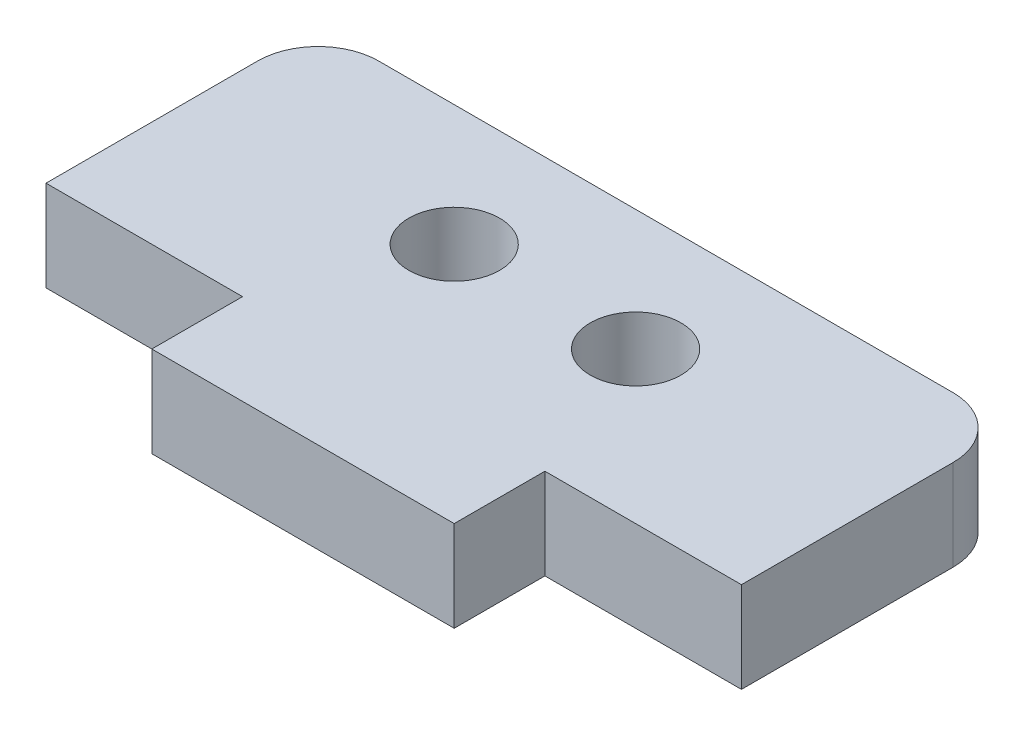
ISO-10303-21;
HEADER;
FILE_DESCRIPTION(('STEP AP214'),'2;1');
FILE_NAME('part.step','',(''),(''),'','','');
FILE_SCHEMA(('AUTOMOTIVE_DESIGN { 1 0 10303 214 1 1 1 1 }'));
ENDSEC;
DATA;
#1=APPLICATION_CONTEXT('core data for automotive mechanical design processes');
#2=APPLICATION_PROTOCOL_DEFINITION('international standard','automotive_design',2000,#1);
#3=PRODUCT_CONTEXT('',#1,'mechanical');
#4=PRODUCT('Part','Part','',(#3));
#5=PRODUCT_RELATED_PRODUCT_CATEGORY('part','',(#4));
#6=PRODUCT_DEFINITION_FORMATION('','',#4);
#7=PRODUCT_DEFINITION_CONTEXT('part definition',#1,'design');
#8=PRODUCT_DEFINITION('design','',#6,#7);
#9=PRODUCT_DEFINITION_SHAPE('','',#8);
#10=(LENGTH_UNIT() NAMED_UNIT(*) SI_UNIT(.MILLI.,.METRE.));
#11=(NAMED_UNIT(*) PLANE_ANGLE_UNIT() SI_UNIT($,.RADIAN.));
#12=(NAMED_UNIT(*) SI_UNIT($,.STERADIAN.) SOLID_ANGLE_UNIT());
#13=UNCERTAINTY_MEASURE_WITH_UNIT(LENGTH_MEASURE(1.E-05),#10,'distance_accuracy_value','');
#14=(GEOMETRIC_REPRESENTATION_CONTEXT(3) GLOBAL_UNCERTAINTY_ASSIGNED_CONTEXT((#13)) GLOBAL_UNIT_ASSIGNED_CONTEXT((#10,
#11,#12)) REPRESENTATION_CONTEXT('',''));
#15=CARTESIAN_POINT('',(0.,0.,0.));
#16=DIRECTION('',(0.,0.,1.));
#17=DIRECTION('',(1.,0.,0.));
#18=AXIS2_PLACEMENT_3D('',#15,#16,#17);
#19=CARTESIAN_POINT('',(7.87032258064516,3.,0.374193548387096));
#20=DIRECTION('',(0.,-1.,0.));
#21=DIRECTION('',(0.,0.,-1.));
#22=AXIS2_PLACEMENT_3D('',#19,#20,#21);
#23=PLANE('',#22);
#24=CARTESIAN_POINT('',(-4.62967741935484,3.,2.3741935483871));
#25=DIRECTION('',(0.,1.,0.));
#26=DIRECTION('',(0.,0.,1.));
#27=AXIS2_PLACEMENT_3D('',#24,#25,#26);
#28=CIRCLE('',#27,1.5);
#29=CARTESIAN_POINT('',(-4.62967741935484,3.,3.8741935483871));
#30=VERTEX_POINT('',#29);
#31=EDGE_CURVE('E145',#30,#30,#28,.T.);
#32=ORIENTED_EDGE('',*,*,#31,.F.);
#33=EDGE_LOOP('',(#32));
#34=FACE_BOUND('',#33,.T.);
#35=CARTESIAN_POINT('',(7.87032258064516,3.,0.374193548387096));
#36=DIRECTION('',(0.,1.,0.));
#37=DIRECTION('',(0.,0.,-1.));
#38=AXIS2_PLACEMENT_3D('',#35,#36,#37);
#39=CIRCLE('',#38,2.);
#40=CARTESIAN_POINT('',(9.87032258064516,3.,0.37419354838711));
#41=VERTEX_POINT('',#40);
#42=CARTESIAN_POINT('',(7.87032258064515,3.,-1.6258064516129));
#43=VERTEX_POINT('',#42);
#44=EDGE_CURVE('E160',#41,#43,#39,.T.);
#45=ORIENTED_EDGE('',*,*,#44,.T.);
#46=DIRECTION('',(-1.,0.,0.));
#47=VECTOR('',#46,1.);
#48=CARTESIAN_POINT('',(-11.1296774193548,3.,-1.6258064516129));
#49=LINE('',#48,#47);
#50=CARTESIAN_POINT('',(-11.1296774193548,3.,-1.6258064516129));
#51=VERTEX_POINT('',#50);
#52=EDGE_CURVE('E98',#43,#51,#49,.T.);
#53=ORIENTED_EDGE('',*,*,#52,.T.);
#54=CARTESIAN_POINT('',(-11.1296774193548,3.,0.374193548387096));
#55=DIRECTION('',(0.,1.,0.));
#56=DIRECTION('',(0.,0.,1.));
#57=AXIS2_PLACEMENT_3D('',#54,#55,#56);
#58=CIRCLE('',#57,2.);
#59=CARTESIAN_POINT('',(-13.1296774193548,3.,0.37419354838711));
#60=VERTEX_POINT('',#59);
#61=EDGE_CURVE('E181',#51,#60,#58,.T.);
#62=ORIENTED_EDGE('',*,*,#61,.T.);
#63=DIRECTION('',(0.,0.,1.));
#64=VECTOR('',#63,1.);
#65=CARTESIAN_POINT('',(-13.1296774193548,3.,0.374193548387111));
#66=LINE('',#65,#64);
#67=CARTESIAN_POINT('',(-13.1296774193548,3.,7.3741935483871));
#68=VERTEX_POINT('',#67);
#69=EDGE_CURVE('E200',#60,#68,#66,.T.);
#70=ORIENTED_EDGE('',*,*,#69,.T.);
#71=DIRECTION('',(1.,0.,0.));
#72=VECTOR('',#71,1.);
#73=CARTESIAN_POINT('',(-13.1296774193548,3.,7.3741935483871));
#74=LINE('',#73,#72);
#75=CARTESIAN_POINT('',(-6.62967741935484,3.,7.3741935483871));
#76=VERTEX_POINT('',#75);
#77=EDGE_CURVE('E197',#68,#76,#74,.T.);
#78=ORIENTED_EDGE('',*,*,#77,.T.);
#79=DIRECTION('',(0.,0.,1.));
#80=VECTOR('',#79,1.);
#81=CARTESIAN_POINT('',(-6.62967741935484,3.,7.3741935483871));
#82=LINE('',#81,#80);
#83=CARTESIAN_POINT('',(-6.62967741935484,3.,10.3741935483871));
#84=VERTEX_POINT('',#83);
#85=EDGE_CURVE('E199',#76,#84,#82,.T.);
#86=ORIENTED_EDGE('',*,*,#85,.T.);
#87=DIRECTION('',(1.,0.,0.));
#88=VECTOR('',#87,1.);
#89=CARTESIAN_POINT('',(-6.62967741935484,3.,10.3741935483871));
#90=LINE('',#89,#88);
#91=CARTESIAN_POINT('',(3.37032258064516,3.,10.3741935483871));
#92=VERTEX_POINT('',#91);
#93=EDGE_CURVE('E123',#84,#92,#90,.T.);
#94=ORIENTED_EDGE('',*,*,#93,.T.);
#95=DIRECTION('',(0.,0.,-1.));
#96=VECTOR('',#95,1.);
#97=CARTESIAN_POINT('',(3.37032258064516,3.,7.3741935483871));
#98=LINE('',#97,#96);
#99=CARTESIAN_POINT('',(3.37032258064516,3.,7.3741935483871));
#100=VERTEX_POINT('',#99);
#101=EDGE_CURVE('E117',#92,#100,#98,.T.);
#102=ORIENTED_EDGE('',*,*,#101,.T.);
#103=DIRECTION('',(1.,0.,0.));
#104=VECTOR('',#103,1.);
#105=CARTESIAN_POINT('',(3.37032258064516,3.,7.3741935483871));
#106=LINE('',#105,#104);
#107=CARTESIAN_POINT('',(9.87032258064516,3.,7.3741935483871));
#108=VERTEX_POINT('',#107);
#109=EDGE_CURVE('E121',#100,#108,#106,.T.);
#110=ORIENTED_EDGE('',*,*,#109,.T.);
#111=DIRECTION('',(0.,0.,-1.));
#112=VECTOR('',#111,1.);
#113=CARTESIAN_POINT('',(9.87032258064516,3.,0.37419354838711));
#114=LINE('',#113,#112);
#115=EDGE_CURVE('E49',#108,#41,#114,.T.);
#116=ORIENTED_EDGE('',*,*,#115,.T.);
#117=EDGE_LOOP('',(#45,#53,#62,#70,#78,#86,#94,#102,#110,#116));
#118=FACE_BOUND('',#117,.T.);
#119=CARTESIAN_POINT('',(1.37032258064516,3.,2.3741935483871));
#120=DIRECTION('',(0.,1.,0.));
#121=DIRECTION('',(0.,0.,1.));
#122=AXIS2_PLACEMENT_3D('',#119,#120,#121);
#123=CIRCLE('',#122,1.5);
#124=CARTESIAN_POINT('',(1.37032258064516,3.,3.8741935483871));
#125=VERTEX_POINT('',#124);
#126=EDGE_CURVE('E211',#125,#125,#123,.T.);
#127=ORIENTED_EDGE('',*,*,#126,.F.);
#128=EDGE_LOOP('',(#127));
#129=FACE_BOUND('',#128,.T.);
#130=ADVANCED_FACE('F32',(#34,#118,#129),#23,.F.);
#131=CARTESIAN_POINT('',(7.87032258064516,0.,0.374193548387096));
#132=DIRECTION('',(0.,-1.,0.));
#133=DIRECTION('',(0.,0.,-1.));
#134=AXIS2_PLACEMENT_3D('',#131,#132,#133);
#135=PLANE('',#134);
#136=CARTESIAN_POINT('',(-4.62967741935484,0.,2.3741935483871));
#137=DIRECTION('',(0.,1.,0.));
#138=DIRECTION('',(0.,0.,1.));
#139=AXIS2_PLACEMENT_3D('',#136,#137,#138);
#140=CIRCLE('',#139,1.5);
#141=CARTESIAN_POINT('',(-4.62967741935484,0.,3.8741935483871));
#142=VERTEX_POINT('',#141);
#143=EDGE_CURVE('E208',#142,#142,#140,.T.);
#144=ORIENTED_EDGE('',*,*,#143,.T.);
#145=EDGE_LOOP('',(#144));
#146=FACE_BOUND('',#145,.T.);
#147=CARTESIAN_POINT('',(7.87032258064516,0.,0.374193548387096));
#148=DIRECTION('',(0.,1.,0.));
#149=DIRECTION('',(0.,0.,-1.));
#150=AXIS2_PLACEMENT_3D('',#147,#148,#149);
#151=CIRCLE('',#150,2.);
#152=CARTESIAN_POINT('',(9.87032258064516,0.,0.37419354838711));
#153=VERTEX_POINT('',#152);
#154=CARTESIAN_POINT('',(7.87032258064515,0.,-1.6258064516129));
#155=VERTEX_POINT('',#154);
#156=EDGE_CURVE('E141',#153,#155,#151,.T.);
#157=ORIENTED_EDGE('',*,*,#156,.F.);
#158=DIRECTION('',(0.,0.,-1.));
#159=VECTOR('',#158,1.);
#160=CARTESIAN_POINT('',(9.87032258064516,0.,0.37419354838711));
#161=LINE('',#160,#159);
#162=CARTESIAN_POINT('',(9.87032258064516,0.,7.3741935483871));
#163=VERTEX_POINT('',#162);
#164=EDGE_CURVE('E90',#163,#153,#161,.T.);
#165=ORIENTED_EDGE('',*,*,#164,.F.);
#166=DIRECTION('',(1.,0.,0.));
#167=VECTOR('',#166,1.);
#168=CARTESIAN_POINT('',(3.37032258064516,0.,7.3741935483871));
#169=LINE('',#168,#167);
#170=CARTESIAN_POINT('',(3.37032258064516,0.,7.3741935483871));
#171=VERTEX_POINT('',#170);
#172=EDGE_CURVE('E84',#171,#163,#169,.T.);
#173=ORIENTED_EDGE('',*,*,#172,.F.);
#174=DIRECTION('',(0.,0.,-1.));
#175=VECTOR('',#174,1.);
#176=CARTESIAN_POINT('',(3.37032258064516,0.,7.3741935483871));
#177=LINE('',#176,#175);
#178=CARTESIAN_POINT('',(3.37032258064516,0.,10.3741935483871));
#179=VERTEX_POINT('',#178);
#180=EDGE_CURVE('E131',#179,#171,#177,.T.);
#181=ORIENTED_EDGE('',*,*,#180,.F.);
#182=DIRECTION('',(1.,0.,0.));
#183=VECTOR('',#182,1.);
#184=CARTESIAN_POINT('',(-6.62967741935484,0.,10.3741935483871));
#185=LINE('',#184,#183);
#186=CARTESIAN_POINT('',(-6.62967741935484,0.,10.3741935483871));
#187=VERTEX_POINT('',#186);
#188=EDGE_CURVE('E155',#187,#179,#185,.T.);
#189=ORIENTED_EDGE('',*,*,#188,.F.);
#190=DIRECTION('',(0.,0.,1.));
#191=VECTOR('',#190,1.);
#192=CARTESIAN_POINT('',(-6.62967741935484,0.,7.3741935483871));
#193=LINE('',#192,#191);
#194=CARTESIAN_POINT('',(-6.62967741935484,0.,7.3741935483871));
#195=VERTEX_POINT('',#194);
#196=EDGE_CURVE('E153',#195,#187,#193,.T.);
#197=ORIENTED_EDGE('',*,*,#196,.F.);
#198=DIRECTION('',(1.,0.,0.));
#199=VECTOR('',#198,1.);
#200=CARTESIAN_POINT('',(-13.1296774193548,0.,7.3741935483871));
#201=LINE('',#200,#199);
#202=CARTESIAN_POINT('',(-13.1296774193548,0.,7.3741935483871));
#203=VERTEX_POINT('',#202);
#204=EDGE_CURVE('E151',#203,#195,#201,.T.);
#205=ORIENTED_EDGE('',*,*,#204,.F.);
#206=DIRECTION('',(0.,0.,1.));
#207=VECTOR('',#206,1.);
#208=CARTESIAN_POINT('',(-13.1296774193548,0.,0.374193548387111));
#209=LINE('',#208,#207);
#210=CARTESIAN_POINT('',(-13.1296774193548,0.,0.37419354838711));
#211=VERTEX_POINT('',#210);
#212=EDGE_CURVE('E149',#211,#203,#209,.T.);
#213=ORIENTED_EDGE('',*,*,#212,.F.);
#214=CARTESIAN_POINT('',(-11.1296774193548,0.,0.374193548387096));
#215=DIRECTION('',(0.,1.,0.));
#216=DIRECTION('',(0.,0.,1.));
#217=AXIS2_PLACEMENT_3D('',#214,#215,#216);
#218=CIRCLE('',#217,2.);
#219=CARTESIAN_POINT('',(-11.1296774193548,0.,-1.6258064516129));
#220=VERTEX_POINT('',#219);
#221=EDGE_CURVE('E147',#220,#211,#218,.T.);
#222=ORIENTED_EDGE('',*,*,#221,.F.);
#223=DIRECTION('',(-1.,0.,0.));
#224=VECTOR('',#223,1.);
#225=CARTESIAN_POINT('',(-11.1296774193548,0.,-1.6258064516129));
#226=LINE('',#225,#224);
#227=EDGE_CURVE('E144',#155,#220,#226,.T.);
#228=ORIENTED_EDGE('',*,*,#227,.F.);
#229=EDGE_LOOP('',(#157,#165,#173,#181,#189,#197,#205,#213,#222,#228));
#230=FACE_BOUND('',#229,.T.);
#231=CARTESIAN_POINT('',(1.37032258064516,0.,2.3741935483871));
#232=DIRECTION('',(0.,1.,0.));
#233=DIRECTION('',(0.,0.,1.));
#234=AXIS2_PLACEMENT_3D('',#231,#232,#233);
#235=CIRCLE('',#234,1.5);
#236=CARTESIAN_POINT('',(1.37032258064516,0.,3.8741935483871));
#237=VERTEX_POINT('',#236);
#238=EDGE_CURVE('E214',#237,#237,#235,.T.);
#239=ORIENTED_EDGE('',*,*,#238,.T.);
#240=EDGE_LOOP('',(#239));
#241=FACE_BOUND('',#240,.T.);
#242=ADVANCED_FACE('F185',(#146,#230,#241),#135,.T.);
#243=CARTESIAN_POINT('',(7.87032258064516,3.,0.374193548387096));
#244=DIRECTION('',(0.,-1.,0.));
#245=DIRECTION('',(0.,0.,-1.));
#246=AXIS2_PLACEMENT_3D('',#243,#244,#245);
#247=CYLINDRICAL_SURFACE('',#246,2.);
#248=ORIENTED_EDGE('',*,*,#156,.T.);
#249=DIRECTION('',(0.,-1.,0.));
#250=VECTOR('',#249,1.);
#251=CARTESIAN_POINT('',(7.87032258064515,3.,-1.6258064516129));
#252=LINE('',#251,#250);
#253=EDGE_CURVE('E11',#43,#155,#252,.T.);
#254=ORIENTED_EDGE('',*,*,#253,.F.);
#255=ORIENTED_EDGE('',*,*,#44,.F.);
#256=DIRECTION('',(0.,-1.,0.));
#257=VECTOR('',#256,1.);
#258=CARTESIAN_POINT('',(9.87032258064516,3.,0.37419354838711));
#259=LINE('',#258,#257);
#260=EDGE_CURVE('E137',#41,#153,#259,.T.);
#261=ORIENTED_EDGE('',*,*,#260,.T.);
#262=EDGE_LOOP('',(#248,#254,#255,#261));
#263=FACE_BOUND('',#262,.T.);
#264=ADVANCED_FACE('F34',(#263),#247,.T.);
#265=CARTESIAN_POINT('',(-11.1296774193548,3.,-1.6258064516129));
#266=DIRECTION('',(0.,0.,1.));
#267=DIRECTION('',(1.,0.,0.));
#268=AXIS2_PLACEMENT_3D('',#265,#266,#267);
#269=PLANE('',#268);
#270=ORIENTED_EDGE('',*,*,#227,.T.);
#271=DIRECTION('',(0.,-1.,0.));
#272=VECTOR('',#271,1.);
#273=CARTESIAN_POINT('',(-11.1296774193548,3.,-1.6258064516129));
#274=LINE('',#273,#272);
#275=EDGE_CURVE('E41',#51,#220,#274,.T.);
#276=ORIENTED_EDGE('',*,*,#275,.F.);
#277=ORIENTED_EDGE('',*,*,#52,.F.);
#278=ORIENTED_EDGE('',*,*,#253,.T.);
#279=EDGE_LOOP('',(#270,#276,#277,#278));
#280=FACE_BOUND('',#279,.T.);
#281=ADVANCED_FACE('F255',(#280),#269,.F.);
#282=CARTESIAN_POINT('',(-11.1296774193548,3.,0.374193548387096));
#283=DIRECTION('',(0.,-1.,0.));
#284=DIRECTION('',(0.,0.,-1.));
#285=AXIS2_PLACEMENT_3D('',#282,#283,#284);
#286=CYLINDRICAL_SURFACE('',#285,2.);
#287=ORIENTED_EDGE('',*,*,#221,.T.);
#288=DIRECTION('',(0.,-1.,0.));
#289=VECTOR('',#288,1.);
#290=CARTESIAN_POINT('',(-13.1296774193548,3.,0.37419354838711));
#291=LINE('',#290,#289);
#292=EDGE_CURVE('E173',#60,#211,#291,.T.);
#293=ORIENTED_EDGE('',*,*,#292,.F.);
#294=ORIENTED_EDGE('',*,*,#61,.F.);
#295=ORIENTED_EDGE('',*,*,#275,.T.);
#296=EDGE_LOOP('',(#287,#293,#294,#295));
#297=FACE_BOUND('',#296,.T.);
#298=ADVANCED_FACE('F179',(#297),#286,.T.);
#299=CARTESIAN_POINT('',(-13.1296774193548,3.,0.374193548387111));
#300=DIRECTION('',(1.,0.,0.));
#301=DIRECTION('',(0.,0.,-1.));
#302=AXIS2_PLACEMENT_3D('',#299,#300,#301);
#303=PLANE('',#302);
#304=ORIENTED_EDGE('',*,*,#212,.T.);
#305=DIRECTION('',(0.,-1.,0.));
#306=VECTOR('',#305,1.);
#307=CARTESIAN_POINT('',(-13.1296774193548,3.,7.3741935483871));
#308=LINE('',#307,#306);
#309=EDGE_CURVE('E170',#68,#203,#308,.T.);
#310=ORIENTED_EDGE('',*,*,#309,.F.);
#311=ORIENTED_EDGE('',*,*,#69,.F.);
#312=ORIENTED_EDGE('',*,*,#292,.T.);
#313=EDGE_LOOP('',(#304,#310,#311,#312));
#314=FACE_BOUND('',#313,.T.);
#315=ADVANCED_FACE('F191',(#314),#303,.F.);
#316=CARTESIAN_POINT('',(-13.1296774193548,3.,7.3741935483871));
#317=DIRECTION('',(0.,0.,-1.));
#318=DIRECTION('',(-1.,0.,0.));
#319=AXIS2_PLACEMENT_3D('',#316,#317,#318);
#320=PLANE('',#319);
#321=ORIENTED_EDGE('',*,*,#204,.T.);
#322=DIRECTION('',(0.,-1.,0.));
#323=VECTOR('',#322,1.);
#324=CARTESIAN_POINT('',(-6.62967741935484,3.,7.3741935483871));
#325=LINE('',#324,#323);
#326=EDGE_CURVE('E167',#76,#195,#325,.T.);
#327=ORIENTED_EDGE('',*,*,#326,.F.);
#328=ORIENTED_EDGE('',*,*,#77,.F.);
#329=ORIENTED_EDGE('',*,*,#309,.T.);
#330=EDGE_LOOP('',(#321,#327,#328,#329));
#331=FACE_BOUND('',#330,.T.);
#332=ADVANCED_FACE('F195',(#331),#320,.F.);
#333=CARTESIAN_POINT('',(-6.62967741935484,3.,7.3741935483871));
#334=DIRECTION('',(1.,0.,0.));
#335=DIRECTION('',(0.,0.,-1.));
#336=AXIS2_PLACEMENT_3D('',#333,#334,#335);
#337=PLANE('',#336);
#338=ORIENTED_EDGE('',*,*,#196,.T.);
#339=DIRECTION('',(0.,-1.,0.));
#340=VECTOR('',#339,1.);
#341=CARTESIAN_POINT('',(-6.62967741935484,3.,10.3741935483871));
#342=LINE('',#341,#340);
#343=EDGE_CURVE('E164',#84,#187,#342,.T.);
#344=ORIENTED_EDGE('',*,*,#343,.F.);
#345=ORIENTED_EDGE('',*,*,#85,.F.);
#346=ORIENTED_EDGE('',*,*,#326,.T.);
#347=EDGE_LOOP('',(#338,#344,#345,#346));
#348=FACE_BOUND('',#347,.T.);
#349=ADVANCED_FACE('F245',(#348),#337,.F.);
#350=CARTESIAN_POINT('',(-6.62967741935484,3.,10.3741935483871));
#351=DIRECTION('',(0.,0.,-1.));
#352=DIRECTION('',(-1.,0.,0.));
#353=AXIS2_PLACEMENT_3D('',#350,#351,#352);
#354=PLANE('',#353);
#355=ORIENTED_EDGE('',*,*,#188,.T.);
#356=DIRECTION('',(0.,-1.,0.));
#357=VECTOR('',#356,1.);
#358=CARTESIAN_POINT('',(3.37032258064516,3.,10.3741935483871));
#359=LINE('',#358,#357);
#360=EDGE_CURVE('E132',#92,#179,#359,.T.);
#361=ORIENTED_EDGE('',*,*,#360,.F.);
#362=ORIENTED_EDGE('',*,*,#93,.F.);
#363=ORIENTED_EDGE('',*,*,#343,.T.);
#364=EDGE_LOOP('',(#355,#361,#362,#363));
#365=FACE_BOUND('',#364,.T.);
#366=ADVANCED_FACE('F242',(#365),#354,.F.);
#367=CARTESIAN_POINT('',(3.37032258064516,3.,7.3741935483871));
#368=DIRECTION('',(-1.,0.,0.));
#369=DIRECTION('',(0.,0.,1.));
#370=AXIS2_PLACEMENT_3D('',#367,#368,#369);
#371=PLANE('',#370);
#372=ORIENTED_EDGE('',*,*,#180,.T.);
#373=DIRECTION('',(0.,-1.,0.));
#374=VECTOR('',#373,1.);
#375=CARTESIAN_POINT('',(3.37032258064516,3.,7.3741935483871));
#376=LINE('',#375,#374);
#377=EDGE_CURVE('E128',#100,#171,#376,.T.);
#378=ORIENTED_EDGE('',*,*,#377,.F.);
#379=ORIENTED_EDGE('',*,*,#101,.F.);
#380=ORIENTED_EDGE('',*,*,#360,.T.);
#381=EDGE_LOOP('',(#372,#378,#379,#380));
#382=FACE_BOUND('',#381,.T.);
#383=ADVANCED_FACE('F129',(#382),#371,.F.);
#384=CARTESIAN_POINT('',(3.37032258064516,3.,7.3741935483871));
#385=DIRECTION('',(0.,0.,-1.));
#386=DIRECTION('',(-1.,0.,0.));
#387=AXIS2_PLACEMENT_3D('',#384,#385,#386);
#388=PLANE('',#387);
#389=ORIENTED_EDGE('',*,*,#172,.T.);
#390=DIRECTION('',(0.,-1.,0.));
#391=VECTOR('',#390,1.);
#392=CARTESIAN_POINT('',(9.87032258064516,3.,7.3741935483871));
#393=LINE('',#392,#391);
#394=EDGE_CURVE('E133',#108,#163,#393,.T.);
#395=ORIENTED_EDGE('',*,*,#394,.F.);
#396=ORIENTED_EDGE('',*,*,#109,.F.);
#397=ORIENTED_EDGE('',*,*,#377,.T.);
#398=EDGE_LOOP('',(#389,#395,#396,#397));
#399=FACE_BOUND('',#398,.T.);
#400=ADVANCED_FACE('F135',(#399),#388,.F.);
#401=CARTESIAN_POINT('',(9.87032258064516,3.,0.37419354838711));
#402=DIRECTION('',(-1.,0.,0.));
#403=DIRECTION('',(0.,0.,1.));
#404=AXIS2_PLACEMENT_3D('',#401,#402,#403);
#405=PLANE('',#404);
#406=ORIENTED_EDGE('',*,*,#164,.T.);
#407=ORIENTED_EDGE('',*,*,#260,.F.);
#408=ORIENTED_EDGE('',*,*,#115,.F.);
#409=ORIENTED_EDGE('',*,*,#394,.T.);
#410=EDGE_LOOP('',(#406,#407,#408,#409));
#411=FACE_BOUND('',#410,.T.);
#412=ADVANCED_FACE('F235',(#411),#405,.F.);
#413=CARTESIAN_POINT('',(-4.62967741935484,3.,2.3741935483871));
#414=DIRECTION('',(0.,-1.,0.));
#415=DIRECTION('',(0.,0.,-1.));
#416=AXIS2_PLACEMENT_3D('',#413,#414,#415);
#417=CYLINDRICAL_SURFACE('',#416,1.5);
#418=ORIENTED_EDGE('',*,*,#31,.T.);
#419=EDGE_LOOP('',(#418));
#420=FACE_BOUND('',#419,.T.);
#421=ORIENTED_EDGE('',*,*,#143,.F.);
#422=EDGE_LOOP('',(#421));
#423=FACE_BOUND('',#422,.T.);
#424=ADVANCED_FACE('F232',(#420,#423),#417,.F.);
#425=CARTESIAN_POINT('',(1.37032258064516,3.,2.3741935483871));
#426=DIRECTION('',(0.,-1.,0.));
#427=DIRECTION('',(0.,0.,-1.));
#428=AXIS2_PLACEMENT_3D('',#425,#426,#427);
#429=CYLINDRICAL_SURFACE('',#428,1.5);
#430=ORIENTED_EDGE('',*,*,#126,.T.);
#431=EDGE_LOOP('',(#430));
#432=FACE_BOUND('',#431,.T.);
#433=ORIENTED_EDGE('',*,*,#238,.F.);
#434=EDGE_LOOP('',(#433));
#435=FACE_BOUND('',#434,.T.);
#436=ADVANCED_FACE('F220',(#432,#435),#429,.F.);
#437=CLOSED_SHELL('',(#130,#242,#264,#281,#298,#315,#332,#349,#366,#383,#400,#412,#424,#436));
#438=MANIFOLD_SOLID_BREP('B2',#437);
#439=ADVANCED_BREP_SHAPE_REPRESENTATION('',(#18,#438),#14);
#440=SHAPE_DEFINITION_REPRESENTATION(#9,#439);
ENDSEC;
END-ISO-10303-21;
